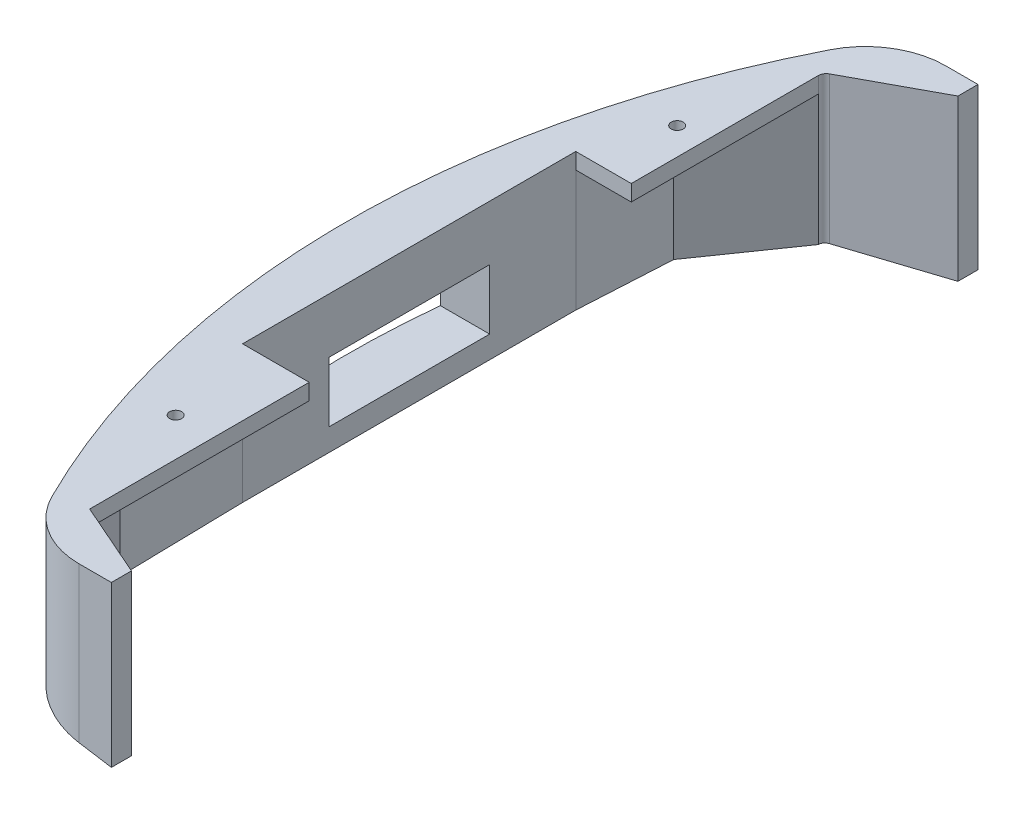
ISO-10303-21;
HEADER;
FILE_DESCRIPTION(('STEP AP214'),'2;1');
FILE_NAME('part.step','',(''),(''),'','','');
FILE_SCHEMA(('AUTOMOTIVE_DESIGN { 1 0 10303 214 1 1 1 1 }'));
ENDSEC;
DATA;
#1=APPLICATION_CONTEXT('core data for automotive mechanical design processes');
#2=APPLICATION_PROTOCOL_DEFINITION('international standard','automotive_design',2000,#1);
#3=PRODUCT_CONTEXT('',#1,'mechanical');
#4=PRODUCT('Part','Part','',(#3));
#5=PRODUCT_RELATED_PRODUCT_CATEGORY('part','',(#4));
#6=PRODUCT_DEFINITION_FORMATION('','',#4);
#7=PRODUCT_DEFINITION_CONTEXT('part definition',#1,'design');
#8=PRODUCT_DEFINITION('design','',#6,#7);
#9=PRODUCT_DEFINITION_SHAPE('','',#8);
#10=(LENGTH_UNIT() NAMED_UNIT(*) SI_UNIT(.MILLI.,.METRE.));
#11=(NAMED_UNIT(*) PLANE_ANGLE_UNIT() SI_UNIT($,.RADIAN.));
#12=(NAMED_UNIT(*) SI_UNIT($,.STERADIAN.) SOLID_ANGLE_UNIT());
#13=UNCERTAINTY_MEASURE_WITH_UNIT(LENGTH_MEASURE(1.E-05),#10,'distance_accuracy_value','');
#14=(GEOMETRIC_REPRESENTATION_CONTEXT(3) GLOBAL_UNCERTAINTY_ASSIGNED_CONTEXT((#13)) GLOBAL_UNIT_ASSIGNED_CONTEXT((#10,
#11,#12)) REPRESENTATION_CONTEXT('',''));
#15=CARTESIAN_POINT('',(0.,0.,0.));
#16=DIRECTION('',(0.,0.,1.));
#17=DIRECTION('',(1.,0.,0.));
#18=AXIS2_PLACEMENT_3D('',#15,#16,#17);
#19=CARTESIAN_POINT('',(-120.13867117166,50.8,-107.999441440313));
#20=DIRECTION('',(0.,-1.,0.));
#21=DIRECTION('',(0.,0.,-1.));
#22=AXIS2_PLACEMENT_3D('',#19,#20,#21);
#23=PLANE('',#22);
#24=CARTESIAN_POINT('',(-120.13867117166,50.8,-107.999441440313));
#25=DIRECTION('',(0.,-1.,0.));
#26=DIRECTION('',(0.,0.,-1.));
#27=AXIS2_PLACEMENT_3D('',#24,#25,#26);
#28=CIRCLE('',#27,2.54);
#29=CARTESIAN_POINT('',(-122.67867117166,50.8,-107.999441440313));
#30=VERTEX_POINT('',#29);
#31=CARTESIAN_POINT('',(-121.345326631998,50.8,-110.23452143889));
#32=VERTEX_POINT('',#31);
#33=EDGE_CURVE('E312',#30,#32,#28,.T.);
#34=ORIENTED_EDGE('',*,*,#33,.T.);
#35=DIRECTION('',(0.879952755345086,0.,-0.475061204857429));
#36=VECTOR('',#35,1.);
#37=CARTESIAN_POINT('',(-94.9613758314156,50.8,-124.478458264008));
#38=LINE('',#37,#36);
#39=CARTESIAN_POINT('',(-94.9613758314156,50.8,-124.478458264008));
#40=VERTEX_POINT('',#39);
#41=EDGE_CURVE('E315',#32,#40,#38,.T.);
#42=ORIENTED_EDGE('',*,*,#41,.T.);
#43=DIRECTION('',(2.49144537022181E-13,0.,-1.));
#44=VECTOR('',#43,1.);
#45=CARTESIAN_POINT('',(-94.9613758314156,50.8,-124.478458264008));
#46=LINE('',#45,#44);
#47=CARTESIAN_POINT('',(-94.961375831414,50.8,-130.828458264007));
#48=VERTEX_POINT('',#47);
#49=EDGE_CURVE('E317',#40,#48,#46,.T.);
#50=ORIENTED_EDGE('',*,*,#49,.T.);
#51=DIRECTION('',(-1.,0.,0.));
#52=VECTOR('',#51,1.);
#53=CARTESIAN_POINT('',(-94.961375831414,50.8,-130.828458264007));
#54=LINE('',#53,#52);
#55=CARTESIAN_POINT('',(-105.241228698568,50.8,-130.828458264008));
#56=VERTEX_POINT('',#55);
#57=EDGE_CURVE('E319',#48,#56,#54,.T.);
#58=ORIENTED_EDGE('',*,*,#57,.T.);
#59=CARTESIAN_POINT('',(-105.241228698568,50.8,-105.428458264008));
#60=DIRECTION('',(0.,1.,0.));
#61=DIRECTION('',(0.,0.,-1.));
#62=AXIS2_PLACEMENT_3D('',#59,#60,#61);
#63=CIRCLE('',#62,25.4);
#64=CARTESIAN_POINT('',(-127.91877537442,50.8,-116.869125935284));
#65=VERTEX_POINT('',#64);
#66=EDGE_CURVE('E321',#56,#65,#63,.T.);
#67=ORIENTED_EDGE('',*,*,#66,.T.);
#68=CARTESIAN_POINT('',(116.713834990151,50.8,6.54635796793397));
#69=DIRECTION('',(0.,1.,0.));
#70=DIRECTION('',(0.,0.,1.));
#71=AXIS2_PLACEMENT_3D('',#68,#69,#70);
#72=CIRCLE('',#71,274.000904598597);
#73=CARTESIAN_POINT('',(-128.532661200605,50.8,128.737404395268));
#74=VERTEX_POINT('',#73);
#75=EDGE_CURVE('E323',#65,#74,#72,.T.);
#76=ORIENTED_EDGE('',*,*,#75,.T.);
#77=CARTESIAN_POINT('',(-105.798207048452,50.8,117.410242597021));
#78=DIRECTION('',(0.,1.,0.));
#79=DIRECTION('',(0.,0.,1.));
#80=AXIS2_PLACEMENT_3D('',#77,#78,#79);
#81=CIRCLE('',#80,25.4);
#82=CARTESIAN_POINT('',(-105.798207048452,50.8,142.810242597021));
#83=VERTEX_POINT('',#82);
#84=EDGE_CURVE('E325',#74,#83,#81,.T.);
#85=ORIENTED_EDGE('',*,*,#84,.T.);
#86=DIRECTION('',(1.,0.,0.));
#87=VECTOR('',#86,1.);
#88=CARTESIAN_POINT('',(-95.6016450834867,50.8,142.810242597021));
#89=LINE('',#88,#87);
#90=CARTESIAN_POINT('',(-95.6016450834867,50.8,142.810242597021));
#91=VERTEX_POINT('',#90);
#92=EDGE_CURVE('E327',#83,#91,#89,.T.);
#93=ORIENTED_EDGE('',*,*,#92,.T.);
#94=DIRECTION('',(0.,0.,-1.));
#95=VECTOR('',#94,1.);
#96=CARTESIAN_POINT('',(-95.6016450834867,50.8,142.810242597021));
#97=LINE('',#96,#95);
#98=CARTESIAN_POINT('',(-95.6016450834867,50.8,136.460242597021));
#99=VERTEX_POINT('',#98);
#100=EDGE_CURVE('E329',#91,#99,#97,.T.);
#101=ORIENTED_EDGE('',*,*,#100,.T.);
#102=DIRECTION('',(-0.915612359132314,0.,-0.402062193950336));
#103=VECTOR('',#102,1.);
#104=CARTESIAN_POINT('',(-119.167015714981,50.8,126.112255784861));
#105=LINE('',#104,#103);
#106=CARTESIAN_POINT('',(-119.167015714981,50.8,126.112255784861));
#107=VERTEX_POINT('',#106);
#108=EDGE_CURVE('E331',#99,#107,#105,.T.);
#109=ORIENTED_EDGE('',*,*,#108,.T.);
#110=DIRECTION('',(0.,0.,-1.));
#111=VECTOR('',#110,1.);
#112=CARTESIAN_POINT('',(-119.167015714981,50.8,56.6451992567958));
#113=LINE('',#112,#111);
#114=CARTESIAN_POINT('',(-119.167015714981,50.8,56.6451992567958));
#115=VERTEX_POINT('',#114);
#116=EDGE_CURVE('E333',#107,#115,#113,.T.);
#117=ORIENTED_EDGE('',*,*,#116,.T.);
#118=DIRECTION('',(-1.,0.,0.));
#119=VECTOR('',#118,1.);
#120=CARTESIAN_POINT('',(-140.25084995853,50.8,56.6451992567958));
#121=LINE('',#120,#119);
#122=CARTESIAN_POINT('',(-140.25084995853,50.8,56.6451992567958));
#123=VERTEX_POINT('',#122);
#124=EDGE_CURVE('E335',#115,#123,#121,.T.);
#125=ORIENTED_EDGE('',*,*,#124,.T.);
#126=DIRECTION('',(0.,0.,-1.));
#127=VECTOR('',#126,1.);
#128=CARTESIAN_POINT('',(-140.25084995853,50.8,-48.8107966844399));
#129=LINE('',#128,#127);
#130=CARTESIAN_POINT('',(-140.25084995853,50.8,-48.8107966844399));
#131=VERTEX_POINT('',#130);
#132=EDGE_CURVE('E337',#123,#131,#129,.T.);
#133=ORIENTED_EDGE('',*,*,#132,.T.);
#134=DIRECTION('',(1.,0.,0.));
#135=VECTOR('',#134,1.);
#136=CARTESIAN_POINT('',(-122.67867117166,50.8,-48.8107966844399));
#137=LINE('',#136,#135);
#138=CARTESIAN_POINT('',(-122.67867117166,50.8,-48.8107966844399));
#139=VERTEX_POINT('',#138);
#140=EDGE_CURVE('E339',#131,#139,#137,.T.);
#141=ORIENTED_EDGE('',*,*,#140,.T.);
#142=DIRECTION('',(0.,0.,-1.));
#143=VECTOR('',#142,1.);
#144=CARTESIAN_POINT('',(-122.67867117166,50.8,-107.999441440313));
#145=LINE('',#144,#143);
#146=EDGE_CURVE('E341',#139,#30,#145,.T.);
#147=ORIENTED_EDGE('',*,*,#146,.T.);
#148=EDGE_LOOP('',(#34,#42,#50,#58,#67,#76,#85,#93,#101,#109,#117,#125,#133,#141,#147));
#149=FACE_BOUND('',#148,.T.);
#150=CARTESIAN_POINT('',(-131.296368681906,50.8,-71.9636007432042));
#151=DIRECTION('',(0.,1.,0.));
#152=DIRECTION('',(0.,0.,1.));
#153=AXIS2_PLACEMENT_3D('',#150,#151,#152);
#154=CIRCLE('',#153,1.90499999999999);
#155=CARTESIAN_POINT('',(-131.296368681906,50.8,-70.0586007432042));
#156=VERTEX_POINT('',#155);
#157=EDGE_CURVE('E307',#156,#156,#154,.T.);
#158=ORIENTED_EDGE('',*,*,#157,.F.);
#159=EDGE_LOOP('',(#158));
#160=FACE_BOUND('',#159,.T.);
#161=CARTESIAN_POINT('',(-131.296368681906,50.8,86.7863992567958));
#162=DIRECTION('',(0.,1.,0.));
#163=DIRECTION('',(0.,0.,1.));
#164=AXIS2_PLACEMENT_3D('',#161,#162,#163);
#165=CIRCLE('',#164,1.90499999999999);
#166=CARTESIAN_POINT('',(-131.296368681906,50.8,88.6913992567958));
#167=VERTEX_POINT('',#166);
#168=EDGE_CURVE('E304',#167,#167,#165,.T.);
#169=ORIENTED_EDGE('',*,*,#168,.F.);
#170=EDGE_LOOP('',(#169));
#171=FACE_BOUND('',#170,.T.);
#172=ADVANCED_FACE('F40',(#149,#160,#171),#23,.F.);
#173=CARTESIAN_POINT('',(-120.13867117166,50.8,-107.999441440313));
#174=DIRECTION('',(0.,-1.,0.));
#175=DIRECTION('',(0.,0.,-1.));
#176=AXIS2_PLACEMENT_3D('',#173,#174,#175);
#177=CYLINDRICAL_SURFACE('',#176,2.54);
#178=DIRECTION('',(0.,-1.,0.));
#179=VECTOR('',#178,1.);
#180=CARTESIAN_POINT('',(-122.67867117166,45.72,-107.999441440313));
#181=LINE('',#180,#179);
#182=CARTESIAN_POINT('',(-122.67867117166,45.72,-107.999441440313));
#183=VERTEX_POINT('',#182);
#184=CARTESIAN_POINT('',(-122.67867117166,4.47229703098231,-107.999441440313));
#185=VERTEX_POINT('',#184);
#186=EDGE_CURVE('E283',#183,#185,#181,.T.);
#187=ORIENTED_EDGE('',*,*,#186,.T.);
#188=CARTESIAN_POINT('',(-120.13867117166,4.06245781978765,-107.999441440313));
#189=DIRECTION('',(0.15929372832516,0.987231233357348,0.));
#190=DIRECTION('',(0.987231233357348,-0.15929372832516,0.));
#191=AXIS2_PLACEMENT_3D('',#188,#189,#190);
#192=ELLIPSE('',#191,2.57285214869271,2.54);
#193=CARTESIAN_POINT('',(-121.345326631998,4.2571565292556,-110.23452143889));
#194=VERTEX_POINT('',#193);
#195=EDGE_CURVE('E241',#185,#194,#192,.F.);
#196=ORIENTED_EDGE('',*,*,#195,.T.);
#197=DIRECTION('',(0.,-1.,0.));
#198=VECTOR('',#197,1.);
#199=CARTESIAN_POINT('',(-121.345326631998,50.8,-110.23452143889));
#200=LINE('',#199,#198);
#201=EDGE_CURVE('E48',#32,#194,#200,.T.);
#202=ORIENTED_EDGE('',*,*,#201,.F.);
#203=ORIENTED_EDGE('',*,*,#33,.F.);
#204=DIRECTION('',(0.,-1.,0.));
#205=VECTOR('',#204,1.);
#206=CARTESIAN_POINT('',(-122.67867117166,50.8,-107.999441440313));
#207=LINE('',#206,#205);
#208=EDGE_CURVE('E343',#30,#183,#207,.T.);
#209=ORIENTED_EDGE('',*,*,#208,.T.);
#210=EDGE_LOOP('',(#187,#196,#202,#203,#209));
#211=FACE_BOUND('',#210,.T.);
#212=ADVANCED_FACE('F42',(#211),#177,.F.);
#213=CARTESIAN_POINT('',(-94.9613758314156,50.8,-124.478458264008));
#214=DIRECTION('',(-0.475061204857429,0.,-0.879952755345086));
#215=DIRECTION('',(-0.879952755345086,0.,0.475061204857429));
#216=AXIS2_PLACEMENT_3D('',#213,#214,#215);
#217=PLANE('',#216);
#218=ORIENTED_EDGE('',*,*,#201,.T.);
#219=DIRECTION('',(0.871214973283533,-0.140574038358858,-0.470343927425512));
#220=VECTOR('',#219,1.);
#221=CARTESIAN_POINT('',(-101.182862350733,1.0038618612343,-121.119656482982));
#222=LINE('',#221,#220);
#223=CARTESIAN_POINT('',(-94.9613758314156,0.,-124.478458264008));
#224=VERTEX_POINT('',#223);
#225=EDGE_CURVE('E246',#194,#224,#222,.T.);
#226=ORIENTED_EDGE('',*,*,#225,.T.);
#227=DIRECTION('',(0.,-1.,0.));
#228=VECTOR('',#227,1.);
#229=CARTESIAN_POINT('',(-94.9613758314156,50.8,-124.478458264008));
#230=LINE('',#229,#228);
#231=EDGE_CURVE('E384',#40,#224,#230,.T.);
#232=ORIENTED_EDGE('',*,*,#231,.F.);
#233=ORIENTED_EDGE('',*,*,#41,.F.);
#234=EDGE_LOOP('',(#218,#226,#232,#233));
#235=FACE_BOUND('',#234,.T.);
#236=ADVANCED_FACE('F470',(#235),#217,.F.);
#237=CARTESIAN_POINT('',(-94.9613758314156,50.8,-124.478458264008));
#238=DIRECTION('',(-1.,0.,-2.49144537022181E-13));
#239=DIRECTION('',(-2.49144537022181E-13,0.,1.));
#240=AXIS2_PLACEMENT_3D('',#237,#238,#239);
#241=PLANE('',#240);
#242=DIRECTION('',(2.49144537022181E-13,0.,-1.));
#243=VECTOR('',#242,1.);
#244=CARTESIAN_POINT('',(-94.9613758314156,0.,-124.478458264008));
#245=LINE('',#244,#243);
#246=CARTESIAN_POINT('',(-94.9613758314156,0.,-130.828458264008));
#247=VERTEX_POINT('',#246);
#248=EDGE_CURVE('E311',#224,#247,#245,.T.);
#249=ORIENTED_EDGE('',*,*,#248,.T.);
#250=DIRECTION('',(0.,-1.,0.));
#251=VECTOR('',#250,1.);
#252=CARTESIAN_POINT('',(-94.961375831414,50.8,-130.828458264007));
#253=LINE('',#252,#251);
#254=EDGE_CURVE('E381',#48,#247,#253,.T.);
#255=ORIENTED_EDGE('',*,*,#254,.F.);
#256=ORIENTED_EDGE('',*,*,#49,.F.);
#257=ORIENTED_EDGE('',*,*,#231,.T.);
#258=EDGE_LOOP('',(#249,#255,#256,#257));
#259=FACE_BOUND('',#258,.T.);
#260=ADVANCED_FACE('F467',(#259),#241,.F.);
#261=CARTESIAN_POINT('',(-94.961375831414,50.8,-130.828458264007));
#262=DIRECTION('',(0.,0.,1.));
#263=DIRECTION('',(1.,0.,0.));
#264=AXIS2_PLACEMENT_3D('',#261,#262,#263);
#265=PLANE('',#264);
#266=ORIENTED_EDGE('',*,*,#254,.T.);
#267=DIRECTION('',(-0.987231233357348,0.15929372832516,0.));
#268=VECTOR('',#267,1.);
#269=CARTESIAN_POINT('',(-157.287069608446,10.0565012498968,-130.828458264008));
#270=LINE('',#269,#268);
#271=CARTESIAN_POINT('',(-105.241228698568,1.65869558672087,-130.828458264008));
#272=VERTEX_POINT('',#271);
#273=EDGE_CURVE('E232',#247,#272,#270,.T.);
#274=ORIENTED_EDGE('',*,*,#273,.T.);
#275=DIRECTION('',(0.,-1.,0.));
#276=VECTOR('',#275,1.);
#277=CARTESIAN_POINT('',(-105.241228698568,50.8,-130.828458264008));
#278=LINE('',#277,#276);
#279=EDGE_CURVE('E378',#56,#272,#278,.T.);
#280=ORIENTED_EDGE('',*,*,#279,.F.);
#281=ORIENTED_EDGE('',*,*,#57,.F.);
#282=EDGE_LOOP('',(#266,#274,#280,#281));
#283=FACE_BOUND('',#282,.T.);
#284=ADVANCED_FACE('F463',(#283),#265,.F.);
#285=CARTESIAN_POINT('',(-105.241228698568,50.8,-105.428458264008));
#286=DIRECTION('',(0.,-1.,0.));
#287=DIRECTION('',(0.,0.,-1.));
#288=AXIS2_PLACEMENT_3D('',#285,#286,#287);
#289=CYLINDRICAL_SURFACE('',#288,25.4);
#290=ORIENTED_EDGE('',*,*,#279,.T.);
#291=CARTESIAN_POINT('',(-105.241228698568,1.65869558672088,-105.428458264008));
#292=DIRECTION('',(0.15929372832516,0.987231233357348,0.));
#293=DIRECTION('',(0.987231233357348,-0.15929372832516,0.));
#294=AXIS2_PLACEMENT_3D('',#291,#292,#293);
#295=ELLIPSE('',#294,25.728521486927,25.4);
#296=CARTESIAN_POINT('',(-127.91877537442,5.31780891013072,-116.869125935284));
#297=VERTEX_POINT('',#296);
#298=EDGE_CURVE('E262',#272,#297,#295,.T.);
#299=ORIENTED_EDGE('',*,*,#298,.T.);
#300=DIRECTION('',(0.,-1.,0.));
#301=VECTOR('',#300,1.);
#302=CARTESIAN_POINT('',(-127.91877537442,50.8,-116.869125935284));
#303=LINE('',#302,#301);
#304=EDGE_CURVE('E375',#65,#297,#303,.T.);
#305=ORIENTED_EDGE('',*,*,#304,.F.);
#306=ORIENTED_EDGE('',*,*,#66,.F.);
#307=EDGE_LOOP('',(#290,#299,#305,#306));
#308=FACE_BOUND('',#307,.T.);
#309=ADVANCED_FACE('F459',(#308),#289,.T.);
#310=CARTESIAN_POINT('',(116.713834990151,50.8,6.54635796793397));
#311=DIRECTION('',(0.,-1.,0.));
#312=DIRECTION('',(0.,0.,-1.));
#313=AXIS2_PLACEMENT_3D('',#310,#311,#312);
#314=CYLINDRICAL_SURFACE('',#313,274.000904598597);
#315=CARTESIAN_POINT('',(116.713834990151,33.4172726963735,6.54635796793397));
#316=DIRECTION('',(0.,1.,0.));
#317=DIRECTION('',(0.,0.,1.));
#318=AXIS2_PLACEMENT_3D('',#315,#316,#317);
#319=CIRCLE('',#318,274.000904598597);
#320=CARTESIAN_POINT('',(-155.84234857806,33.4172726963735,-21.5538647995298));
#321=VERTEX_POINT('',#320);
#322=CARTESIAN_POINT('',(-156.345161994827,33.4172726963735,29.2461352004702));
#323=VERTEX_POINT('',#322);
#324=EDGE_CURVE('E225',#321,#323,#319,.T.);
#325=ORIENTED_EDGE('',*,*,#324,.T.);
#326=DIRECTION('',(0.,-1.,0.));
#327=VECTOR('',#326,1.);
#328=CARTESIAN_POINT('',(-156.345161994827,50.8,29.2461352004702));
#329=LINE('',#328,#327);
#330=CARTESIAN_POINT('',(-156.345161994827,14.3672726963735,29.2461352004702));
#331=VERTEX_POINT('',#330);
#332=EDGE_CURVE('E228',#323,#331,#329,.T.);
#333=ORIENTED_EDGE('',*,*,#332,.T.);
#334=CARTESIAN_POINT('',(116.713834990151,14.3672726963735,6.54635796793397));
#335=DIRECTION('',(0.,-1.,0.));
#336=DIRECTION('',(0.,0.,-1.));
#337=AXIS2_PLACEMENT_3D('',#334,#335,#336);
#338=CIRCLE('',#337,274.000904598597);
#339=CARTESIAN_POINT('',(-155.84234857806,14.3672726963735,-21.5538647995298));
#340=VERTEX_POINT('',#339);
#341=EDGE_CURVE('E220',#331,#340,#338,.T.);
#342=ORIENTED_EDGE('',*,*,#341,.T.);
#343=DIRECTION('',(0.,-1.,0.));
#344=VECTOR('',#343,1.);
#345=CARTESIAN_POINT('',(-155.84234857806,50.8,-21.5538647995298));
#346=LINE('',#345,#344);
#347=EDGE_CURVE('E200',#340,#321,#346,.F.);
#348=ORIENTED_EDGE('',*,*,#347,.T.);
#349=EDGE_LOOP('',(#325,#333,#342,#348));
#350=FACE_BOUND('',#349,.T.);
#351=ORIENTED_EDGE('',*,*,#304,.T.);
#352=CARTESIAN_POINT('',(116.713834990151,-34.154646233297,6.54635796793397));
#353=DIRECTION('',(0.15929372832516,0.987231233357348,0.));
#354=DIRECTION('',(0.987231233357348,-0.15929372832516,0.));
#355=AXIS2_PLACEMENT_3D('',#352,#353,#354);
#356=ELLIPSE('',#355,277.544809504033,274.000904598597);
#357=CARTESIAN_POINT('',(-128.532661200605,5.4168618561021,128.737404395268));
#358=VERTEX_POINT('',#357);
#359=EDGE_CURVE('E260',#297,#358,#356,.T.);
#360=ORIENTED_EDGE('',*,*,#359,.T.);
#361=DIRECTION('',(0.,-1.,0.));
#362=VECTOR('',#361,1.);
#363=CARTESIAN_POINT('',(-128.532661200605,50.8,128.737404395268));
#364=LINE('',#363,#362);
#365=EDGE_CURVE('E372',#74,#358,#364,.T.);
#366=ORIENTED_EDGE('',*,*,#365,.F.);
#367=ORIENTED_EDGE('',*,*,#75,.F.);
#368=EDGE_LOOP('',(#351,#360,#366,#367));
#369=FACE_BOUND('',#368,.T.);
#370=ADVANCED_FACE('F455',(#350,#369),#314,.T.);
#371=CARTESIAN_POINT('',(-105.798207048452,50.8,117.410242597021));
#372=DIRECTION('',(0.,-1.,0.));
#373=DIRECTION('',(0.,0.,-1.));
#374=AXIS2_PLACEMENT_3D('',#371,#372,#373);
#375=CYLINDRICAL_SURFACE('',#374,25.4);
#376=ORIENTED_EDGE('',*,*,#365,.T.);
#377=CARTESIAN_POINT('',(-105.798207048452,1.74856628261411,117.410242597021));
#378=DIRECTION('',(0.15929372832516,0.987231233357348,0.));
#379=DIRECTION('',(0.987231233357348,-0.15929372832516,0.));
#380=AXIS2_PLACEMENT_3D('',#377,#378,#379);
#381=ELLIPSE('',#380,25.728521486927,25.4);
#382=CARTESIAN_POINT('',(-105.798207048452,1.74856628261411,142.810242597021));
#383=VERTEX_POINT('',#382);
#384=EDGE_CURVE('E257',#358,#383,#381,.T.);
#385=ORIENTED_EDGE('',*,*,#384,.T.);
#386=DIRECTION('',(0.,-1.,0.));
#387=VECTOR('',#386,1.);
#388=CARTESIAN_POINT('',(-105.798207048452,50.8,142.810242597021));
#389=LINE('',#388,#387);
#390=EDGE_CURVE('E369',#83,#383,#389,.T.);
#391=ORIENTED_EDGE('',*,*,#390,.F.);
#392=ORIENTED_EDGE('',*,*,#84,.F.);
#393=EDGE_LOOP('',(#376,#385,#391,#392));
#394=FACE_BOUND('',#393,.T.);
#395=ADVANCED_FACE('F451',(#394),#375,.T.);
#396=CARTESIAN_POINT('',(-95.6016450834867,50.8,142.810242597021));
#397=DIRECTION('',(0.,0.,-1.));
#398=DIRECTION('',(-1.,0.,0.));
#399=AXIS2_PLACEMENT_3D('',#396,#397,#398);
#400=PLANE('',#399);
#401=ORIENTED_EDGE('',*,*,#390,.T.);
#402=DIRECTION('',(-0.987231233357348,0.15929372832516,0.));
#403=VECTOR('',#402,1.);
#404=CARTESIAN_POINT('',(-157.287069608446,10.0565012498968,142.810242597021));
#405=LINE('',#404,#403);
#406=CARTESIAN_POINT('',(-95.6016450834867,0.10331001780356,142.810242597021));
#407=VERTEX_POINT('',#406);
#408=EDGE_CURVE('E231',#407,#383,#405,.T.);
#409=ORIENTED_EDGE('',*,*,#408,.F.);
#410=DIRECTION('',(0.,-1.,0.));
#411=VECTOR('',#410,1.);
#412=CARTESIAN_POINT('',(-95.6016450834867,50.8,142.810242597021));
#413=LINE('',#412,#411);
#414=EDGE_CURVE('E366',#91,#407,#413,.T.);
#415=ORIENTED_EDGE('',*,*,#414,.F.);
#416=ORIENTED_EDGE('',*,*,#92,.F.);
#417=EDGE_LOOP('',(#401,#409,#415,#416));
#418=FACE_BOUND('',#417,.T.);
#419=ADVANCED_FACE('F447',(#418),#400,.F.);
#420=CARTESIAN_POINT('',(-95.6016450834867,50.8,142.810242597021));
#421=DIRECTION('',(-1.,0.,0.));
#422=DIRECTION('',(0.,0.,1.));
#423=AXIS2_PLACEMENT_3D('',#420,#421,#422);
#424=PLANE('',#423);
#425=ORIENTED_EDGE('',*,*,#414,.T.);
#426=DIRECTION('',(0.,0.,-1.));
#427=VECTOR('',#426,1.);
#428=CARTESIAN_POINT('',(-95.6016450834867,0.10331001780356,142.810242597021));
#429=LINE('',#428,#427);
#430=CARTESIAN_POINT('',(-95.6016450834867,0.103310017803553,136.460242597021));
#431=VERTEX_POINT('',#430);
#432=EDGE_CURVE('E254',#407,#431,#429,.T.);
#433=ORIENTED_EDGE('',*,*,#432,.T.);
#434=DIRECTION('',(0.,-1.,0.));
#435=VECTOR('',#434,1.);
#436=CARTESIAN_POINT('',(-95.6016450834867,50.8,136.460242597021));
#437=LINE('',#436,#435);
#438=EDGE_CURVE('E363',#99,#431,#437,.T.);
#439=ORIENTED_EDGE('',*,*,#438,.F.);
#440=ORIENTED_EDGE('',*,*,#100,.F.);
#441=EDGE_LOOP('',(#425,#433,#439,#440));
#442=FACE_BOUND('',#441,.T.);
#443=ADVANCED_FACE('F443',(#442),#424,.F.);
#444=CARTESIAN_POINT('',(-119.167015714981,50.8,126.112255784861));
#445=DIRECTION('',(-0.402062193950336,0.,0.915612359132314));
#446=DIRECTION('',(0.915612359132315,0.,0.402062193950336));
#447=AXIS2_PLACEMENT_3D('',#444,#445,#446);
#448=PLANE('',#447);
#449=ORIENTED_EDGE('',*,*,#438,.T.);
#450=DIRECTION('',(-0.905780733225963,0.146151362685295,-0.397744946544728));
#451=VECTOR('',#450,1.);
#452=CARTESIAN_POINT('',(-125.374937195622,4.90735039335706,123.386243509598));
#453=LINE('',#452,#451);
#454=CARTESIAN_POINT('',(-119.167015714981,3.90567730564666,126.112255784861));
#455=VERTEX_POINT('',#454);
#456=EDGE_CURVE('E251',#431,#455,#453,.T.);
#457=ORIENTED_EDGE('',*,*,#456,.T.);
#458=DIRECTION('',(0.,-1.,0.));
#459=VECTOR('',#458,1.);
#460=CARTESIAN_POINT('',(-119.167015714981,45.72,126.112255784861));
#461=LINE('',#460,#459);
#462=CARTESIAN_POINT('',(-119.167015714981,45.72,126.112255784861));
#463=VERTEX_POINT('',#462);
#464=EDGE_CURVE('E296',#463,#455,#461,.T.);
#465=ORIENTED_EDGE('',*,*,#464,.F.);
#466=DIRECTION('',(0.,-1.,0.));
#467=VECTOR('',#466,1.);
#468=CARTESIAN_POINT('',(-119.167015714981,50.8,126.112255784861));
#469=LINE('',#468,#467);
#470=EDGE_CURVE('E360',#107,#463,#469,.T.);
#471=ORIENTED_EDGE('',*,*,#470,.F.);
#472=ORIENTED_EDGE('',*,*,#108,.F.);
#473=EDGE_LOOP('',(#449,#457,#465,#471,#472));
#474=FACE_BOUND('',#473,.T.);
#475=ADVANCED_FACE('F439',(#474),#448,.F.);
#476=CARTESIAN_POINT('',(-119.167015714981,50.8,56.6451992567958));
#477=DIRECTION('',(-1.,0.,0.));
#478=DIRECTION('',(0.,0.,1.));
#479=AXIS2_PLACEMENT_3D('',#476,#477,#478);
#480=PLANE('',#479);
#481=ORIENTED_EDGE('',*,*,#470,.T.);
#482=DIRECTION('',(0.,0.,-1.));
#483=VECTOR('',#482,1.);
#484=CARTESIAN_POINT('',(-119.167015714981,45.72,126.112255784861));
#485=LINE('',#484,#483);
#486=CARTESIAN_POINT('',(-119.167015714981,45.72,56.6451992567958));
#487=VERTEX_POINT('',#486);
#488=EDGE_CURVE('E265',#463,#487,#485,.T.);
#489=ORIENTED_EDGE('',*,*,#488,.T.);
#490=DIRECTION('',(0.,-1.,0.));
#491=VECTOR('',#490,1.);
#492=CARTESIAN_POINT('',(-119.167015714981,50.8,56.6451992567958));
#493=LINE('',#492,#491);
#494=EDGE_CURVE('E357',#115,#487,#493,.T.);
#495=ORIENTED_EDGE('',*,*,#494,.F.);
#496=ORIENTED_EDGE('',*,*,#116,.F.);
#497=EDGE_LOOP('',(#481,#489,#495,#496));
#498=FACE_BOUND('',#497,.T.);
#499=ADVANCED_FACE('F435',(#498),#480,.F.);
#500=CARTESIAN_POINT('',(-140.25084995853,50.8,56.6451992567958));
#501=DIRECTION('',(0.,0.,1.));
#502=DIRECTION('',(1.,0.,0.));
#503=AXIS2_PLACEMENT_3D('',#500,#501,#502);
#504=PLANE('',#503);
#505=ORIENTED_EDGE('',*,*,#494,.T.);
#506=DIRECTION('',(-1.,0.,0.));
#507=VECTOR('',#506,1.);
#508=CARTESIAN_POINT('',(-119.167015714981,45.72,56.6451992567958));
#509=LINE('',#508,#507);
#510=CARTESIAN_POINT('',(-140.25084995853,45.72,56.6451992567958));
#511=VERTEX_POINT('',#510);
#512=EDGE_CURVE('E289',#487,#511,#509,.T.);
#513=ORIENTED_EDGE('',*,*,#512,.T.);
#514=DIRECTION('',(0.,-1.,0.));
#515=VECTOR('',#514,1.);
#516=CARTESIAN_POINT('',(-140.25084995853,50.8,56.6451992567958));
#517=LINE('',#516,#515);
#518=EDGE_CURVE('E354',#123,#511,#517,.T.);
#519=ORIENTED_EDGE('',*,*,#518,.F.);
#520=ORIENTED_EDGE('',*,*,#124,.F.);
#521=EDGE_LOOP('',(#505,#513,#519,#520));
#522=FACE_BOUND('',#521,.T.);
#523=ADVANCED_FACE('F432',(#522),#504,.F.);
#524=CARTESIAN_POINT('',(-140.25084995853,50.8,-48.8107966844399));
#525=DIRECTION('',(-1.,0.,0.));
#526=DIRECTION('',(0.,0.,1.));
#527=AXIS2_PLACEMENT_3D('',#524,#525,#526);
#528=PLANE('',#527);
#529=DIRECTION('',(0.,0.,-1.));
#530=VECTOR('',#529,1.);
#531=CARTESIAN_POINT('',(-140.25084995853,14.3672726963735,29.2461352004702));
#532=LINE('',#531,#530);
#533=CARTESIAN_POINT('',(-140.25084995853,14.3672726963735,29.2461352004702));
#534=VERTEX_POINT('',#533);
#535=CARTESIAN_POINT('',(-140.25084995853,14.3672726963735,-21.5538647995298));
#536=VERTEX_POINT('',#535);
#537=EDGE_CURVE('E206',#534,#536,#532,.T.);
#538=ORIENTED_EDGE('',*,*,#537,.F.);
#539=DIRECTION('',(0.,-1.,0.));
#540=VECTOR('',#539,1.);
#541=CARTESIAN_POINT('',(-140.25084995853,33.4172726963735,29.2461352004702));
#542=LINE('',#541,#540);
#543=CARTESIAN_POINT('',(-140.25084995853,33.4172726963735,29.2461352004702));
#544=VERTEX_POINT('',#543);
#545=EDGE_CURVE('E63',#544,#534,#542,.T.);
#546=ORIENTED_EDGE('',*,*,#545,.F.);
#547=DIRECTION('',(0.,0.,1.));
#548=VECTOR('',#547,1.);
#549=CARTESIAN_POINT('',(-140.25084995853,33.4172726963735,29.2461352004702));
#550=LINE('',#549,#548);
#551=CARTESIAN_POINT('',(-140.25084995853,33.4172726963735,-21.5538647995298));
#552=VERTEX_POINT('',#551);
#553=EDGE_CURVE('E213',#552,#544,#550,.T.);
#554=ORIENTED_EDGE('',*,*,#553,.F.);
#555=DIRECTION('',(0.,1.,0.));
#556=VECTOR('',#555,1.);
#557=CARTESIAN_POINT('',(-140.25084995853,33.4172726963735,-21.5538647995298));
#558=LINE('',#557,#556);
#559=EDGE_CURVE('E197',#536,#552,#558,.T.);
#560=ORIENTED_EDGE('',*,*,#559,.F.);
#561=EDGE_LOOP('',(#538,#546,#554,#560));
#562=FACE_BOUND('',#561,.T.);
#563=DIRECTION('',(0.,-1.,0.));
#564=VECTOR('',#563,1.);
#565=CARTESIAN_POINT('',(-140.25084995853,45.72,56.6451992567958));
#566=LINE('',#565,#564);
#567=CARTESIAN_POINT('',(-140.25084995853,7.30763872113292,56.6451992567958));
#568=VERTEX_POINT('',#567);
#569=EDGE_CURVE('E270',#511,#568,#566,.T.);
#570=ORIENTED_EDGE('',*,*,#569,.T.);
#571=DIRECTION('',(0.,0.,-1.));
#572=VECTOR('',#571,1.);
#573=CARTESIAN_POINT('',(-140.25084995853,7.30763872113292,-48.8107966844399));
#574=LINE('',#573,#572);
#575=CARTESIAN_POINT('',(-140.25084995853,7.30763872113291,-48.8107966844399));
#576=VERTEX_POINT('',#575);
#577=EDGE_CURVE('E238',#568,#576,#574,.T.);
#578=ORIENTED_EDGE('',*,*,#577,.T.);
#579=DIRECTION('',(0.,-1.,0.));
#580=VECTOR('',#579,1.);
#581=CARTESIAN_POINT('',(-140.25084995853,45.72,-48.8107966844399));
#582=LINE('',#581,#580);
#583=CARTESIAN_POINT('',(-140.25084995853,45.72,-48.8107966844399));
#584=VERTEX_POINT('',#583);
#585=EDGE_CURVE('E277',#584,#576,#582,.T.);
#586=ORIENTED_EDGE('',*,*,#585,.F.);
#587=DIRECTION('',(0.,-1.,0.));
#588=VECTOR('',#587,1.);
#589=CARTESIAN_POINT('',(-140.25084995853,50.8,-48.8107966844399));
#590=LINE('',#589,#588);
#591=EDGE_CURVE('E351',#131,#584,#590,.T.);
#592=ORIENTED_EDGE('',*,*,#591,.F.);
#593=ORIENTED_EDGE('',*,*,#132,.F.);
#594=ORIENTED_EDGE('',*,*,#518,.T.);
#595=EDGE_LOOP('',(#570,#578,#586,#592,#593,#594));
#596=FACE_BOUND('',#595,.T.);
#597=ADVANCED_FACE('F210',(#562,#596),#528,.F.);
#598=CARTESIAN_POINT('',(-122.67867117166,50.8,-48.8107966844399));
#599=DIRECTION('',(0.,0.,-1.));
#600=DIRECTION('',(-1.,0.,0.));
#601=AXIS2_PLACEMENT_3D('',#598,#599,#600);
#602=PLANE('',#601);
#603=ORIENTED_EDGE('',*,*,#591,.T.);
#604=DIRECTION('',(1.,0.,0.));
#605=VECTOR('',#604,1.);
#606=CARTESIAN_POINT('',(-140.25084995853,45.72,-48.8107966844399));
#607=LINE('',#606,#605);
#608=CARTESIAN_POINT('',(-122.67867117166,45.72,-48.8107966844399));
#609=VERTEX_POINT('',#608);
#610=EDGE_CURVE('E266',#584,#609,#607,.T.);
#611=ORIENTED_EDGE('',*,*,#610,.T.);
#612=DIRECTION('',(0.,-1.,0.));
#613=VECTOR('',#612,1.);
#614=CARTESIAN_POINT('',(-122.67867117166,50.8,-48.8107966844399));
#615=LINE('',#614,#613);
#616=EDGE_CURVE('E348',#139,#609,#615,.T.);
#617=ORIENTED_EDGE('',*,*,#616,.F.);
#618=ORIENTED_EDGE('',*,*,#140,.F.);
#619=EDGE_LOOP('',(#603,#611,#617,#618));
#620=FACE_BOUND('',#619,.T.);
#621=ADVANCED_FACE('F425',(#620),#602,.F.);
#622=CARTESIAN_POINT('',(-122.67867117166,50.8,-107.999441440313));
#623=DIRECTION('',(-1.,0.,0.));
#624=DIRECTION('',(0.,0.,1.));
#625=AXIS2_PLACEMENT_3D('',#622,#623,#624);
#626=PLANE('',#625);
#627=ORIENTED_EDGE('',*,*,#616,.T.);
#628=DIRECTION('',(0.,0.,-1.));
#629=VECTOR('',#628,1.);
#630=CARTESIAN_POINT('',(-122.67867117166,45.72,-48.8107966844399));
#631=LINE('',#630,#629);
#632=EDGE_CURVE('E269',#609,#183,#631,.T.);
#633=ORIENTED_EDGE('',*,*,#632,.T.);
#634=ORIENTED_EDGE('',*,*,#208,.F.);
#635=ORIENTED_EDGE('',*,*,#146,.F.);
#636=EDGE_LOOP('',(#627,#633,#634,#635));
#637=FACE_BOUND('',#636,.T.);
#638=ADVANCED_FACE('F400',(#637),#626,.F.);
#639=CARTESIAN_POINT('',(-131.296368681906,50.8,-71.9636007432042));
#640=DIRECTION('',(0.,-1.,0.));
#641=DIRECTION('',(0.,0.,-1.));
#642=AXIS2_PLACEMENT_3D('',#639,#640,#641);
#643=CYLINDRICAL_SURFACE('',#642,1.90499999999999);
#644=CARTESIAN_POINT('',(-131.296368681906,45.72,-71.9636007432042));
#645=DIRECTION('',(0.,1.,0.));
#646=DIRECTION('',(0.,0.,1.));
#647=AXIS2_PLACEMENT_3D('',#644,#645,#646);
#648=CIRCLE('',#647,1.90499999999999);
#649=CARTESIAN_POINT('',(-131.296368681906,45.72,-70.0586007432042));
#650=VERTEX_POINT('',#649);
#651=EDGE_CURVE('E308',#650,#650,#648,.T.);
#652=ORIENTED_EDGE('',*,*,#651,.F.);
#653=EDGE_LOOP('',(#652));
#654=FACE_BOUND('',#653,.T.);
#655=ORIENTED_EDGE('',*,*,#157,.T.);
#656=EDGE_LOOP('',(#655));
#657=FACE_BOUND('',#656,.T.);
#658=ADVANCED_FACE('F396',(#654,#657),#643,.F.);
#659=CARTESIAN_POINT('',(-131.296368681906,50.8,86.7863992567958));
#660=DIRECTION('',(0.,-1.,0.));
#661=DIRECTION('',(0.,0.,-1.));
#662=AXIS2_PLACEMENT_3D('',#659,#660,#661);
#663=CYLINDRICAL_SURFACE('',#662,1.90499999999999);
#664=CARTESIAN_POINT('',(-131.296368681906,45.72,86.7863992567958));
#665=DIRECTION('',(0.,1.,0.));
#666=DIRECTION('',(0.,0.,1.));
#667=AXIS2_PLACEMENT_3D('',#664,#665,#666);
#668=CIRCLE('',#667,1.90499999999999);
#669=CARTESIAN_POINT('',(-131.296368681906,45.72,88.6913992567958));
#670=VERTEX_POINT('',#669);
#671=EDGE_CURVE('E286',#670,#670,#668,.T.);
#672=ORIENTED_EDGE('',*,*,#671,.F.);
#673=EDGE_LOOP('',(#672));
#674=FACE_BOUND('',#673,.T.);
#675=ORIENTED_EDGE('',*,*,#168,.T.);
#676=EDGE_LOOP('',(#675));
#677=FACE_BOUND('',#676,.T.);
#678=ADVANCED_FACE('F399',(#674,#677),#663,.F.);
#679=CARTESIAN_POINT('',(-140.25084995853,45.72,56.6451992567958));
#680=DIRECTION('',(0.999839432639536,0.,-0.0179195128017252));
#681=DIRECTION('',(-0.0179195128017252,0.,-0.999839432639536));
#682=AXIS2_PLACEMENT_3D('',#679,#680,#681);
#683=PLANE('',#682);
#684=DIRECTION('',(0.0179194378976484,-0.00289137334371021,0.999835253282069));
#685=VECTOR('',#684,1.);
#686=CARTESIAN_POINT('',(-140.252840171537,7.3079598500025,56.5341530768333));
#687=LINE('',#686,#685);
#688=CARTESIAN_POINT('',(-139.542068036554,7.19327390860855,96.1924862045695));
#689=VERTEX_POINT('',#688);
#690=EDGE_CURVE('E244',#568,#689,#687,.T.);
#691=ORIENTED_EDGE('',*,*,#690,.F.);
#692=ORIENTED_EDGE('',*,*,#569,.F.);
#693=DIRECTION('',(0.0179195128017252,0.,0.999839432639536));
#694=VECTOR('',#693,1.);
#695=CARTESIAN_POINT('',(-140.25084995853,45.72,56.6451992567958));
#696=LINE('',#695,#694);
#697=CARTESIAN_POINT('',(-139.542068036554,45.72,96.1924862045695));
#698=VERTEX_POINT('',#697);
#699=EDGE_CURVE('E292',#511,#698,#696,.T.);
#700=ORIENTED_EDGE('',*,*,#699,.T.);
#701=DIRECTION('',(0.,-1.,0.));
#702=VECTOR('',#701,1.);
#703=CARTESIAN_POINT('',(-139.542068036554,45.72,96.1924862045695));
#704=LINE('',#703,#702);
#705=EDGE_CURVE('E299',#698,#689,#704,.T.);
#706=ORIENTED_EDGE('',*,*,#705,.T.);
#707=EDGE_LOOP('',(#691,#692,#700,#706));
#708=FACE_BOUND('',#707,.T.);
#709=ADVANCED_FACE('F411',(#708),#683,.T.);
#710=CARTESIAN_POINT('',(-139.542068036554,45.72,96.1924862045695));
#711=DIRECTION('',(0.826545969979296,0.,-0.562869220610778));
#712=DIRECTION('',(-0.562869220610778,0.,-0.826545969979296));
#713=AXIS2_PLACEMENT_3D('',#710,#711,#712);
#714=PLANE('',#713);
#715=DIRECTION('',(0.560562072446866,-0.0904489439359321,0.823158035540533));
#716=VECTOR('',#715,1.);
#717=CARTESIAN_POINT('',(-141.495459636792,7.50846149624481,93.324026008404));
#718=LINE('',#717,#716);
#719=EDGE_CURVE('E249',#689,#455,#718,.T.);
#720=ORIENTED_EDGE('',*,*,#719,.F.);
#721=ORIENTED_EDGE('',*,*,#705,.F.);
#722=DIRECTION('',(0.562869220610778,0.,0.826545969979296));
#723=VECTOR('',#722,1.);
#724=CARTESIAN_POINT('',(-139.542068036554,45.72,96.1924862045695));
#725=LINE('',#724,#723);
#726=EDGE_CURVE('E294',#698,#463,#725,.T.);
#727=ORIENTED_EDGE('',*,*,#726,.T.);
#728=ORIENTED_EDGE('',*,*,#464,.T.);
#729=EDGE_LOOP('',(#720,#721,#727,#728));
#730=FACE_BOUND('',#729,.T.);
#731=ADVANCED_FACE('F417',(#730),#714,.T.);
#732=CARTESIAN_POINT('',(0.,45.72,0.));
#733=DIRECTION('',(0.,1.,0.));
#734=DIRECTION('',(0.,0.,1.));
#735=AXIS2_PLACEMENT_3D('',#732,#733,#734);
#736=PLANE('',#735);
#737=ORIENTED_EDGE('',*,*,#671,.T.);
#738=EDGE_LOOP('',(#737));
#739=FACE_BOUND('',#738,.T.);
#740=ORIENTED_EDGE('',*,*,#488,.F.);
#741=ORIENTED_EDGE('',*,*,#726,.F.);
#742=ORIENTED_EDGE('',*,*,#699,.F.);
#743=ORIENTED_EDGE('',*,*,#512,.F.);
#744=EDGE_LOOP('',(#740,#741,#742,#743));
#745=FACE_BOUND('',#744,.T.);
#746=ADVANCED_FACE('F506',(#739,#745),#736,.F.);
#747=CARTESIAN_POINT('',(-122.67867117166,45.72,-107.999441440313));
#748=DIRECTION('',(0.877742702186898,0.,0.479132287325371));
#749=DIRECTION('',(0.479132287325371,0.,-0.877742702186898));
#750=AXIS2_PLACEMENT_3D('',#747,#748,#749);
#751=PLANE('',#750);
#752=DIRECTION('',(-0.477706829295867,0.077079917362567,0.875131345332499));
#753=VECTOR('',#752,1.);
#754=CARTESIAN_POINT('',(-124.19747771198,4.71736257210133,-105.217075500748));
#755=LINE('',#754,#753);
#756=CARTESIAN_POINT('',(-138.833286114577,7.07890909608419,-78.4051190623766));
#757=VERTEX_POINT('',#756);
#758=EDGE_CURVE('E235',#185,#757,#755,.T.);
#759=ORIENTED_EDGE('',*,*,#758,.F.);
#760=ORIENTED_EDGE('',*,*,#186,.F.);
#761=DIRECTION('',(-0.479132287325371,0.,0.877742702186898));
#762=VECTOR('',#761,1.);
#763=CARTESIAN_POINT('',(-122.67867117166,45.72,-107.999441440313));
#764=LINE('',#763,#762);
#765=CARTESIAN_POINT('',(-138.833286114577,45.72,-78.4051190623766));
#766=VERTEX_POINT('',#765);
#767=EDGE_CURVE('E273',#183,#766,#764,.T.);
#768=ORIENTED_EDGE('',*,*,#767,.T.);
#769=DIRECTION('',(0.,-1.,0.));
#770=VECTOR('',#769,1.);
#771=CARTESIAN_POINT('',(-138.833286114577,45.72,-78.4051190623766));
#772=LINE('',#771,#770);
#773=EDGE_CURVE('E280',#766,#757,#772,.T.);
#774=ORIENTED_EDGE('',*,*,#773,.T.);
#775=EDGE_LOOP('',(#759,#760,#768,#774));
#776=FACE_BOUND('',#775,.T.);
#777=ADVANCED_FACE('F487',(#776),#751,.T.);
#778=CARTESIAN_POINT('',(-138.833286114577,45.72,-78.4051190623766));
#779=DIRECTION('',(0.998854772123279,0.,0.0478450018973053));
#780=DIRECTION('',(0.0478450018973053,0.,-0.998854772123279));
#781=AXIS2_PLACEMENT_3D('',#778,#779,#780);
#782=PLANE('',#781);
#783=DIRECTION('',(-0.0478435762243813,0.00771975336241419,0.99882500850854));
#784=VECTOR('',#783,1.);
#785=CARTESIAN_POINT('',(-138.847557838602,7.08121189613013,-78.1071698705431));
#786=LINE('',#785,#784);
#787=EDGE_CURVE('E11',#757,#576,#786,.T.);
#788=ORIENTED_EDGE('',*,*,#787,.F.);
#789=ORIENTED_EDGE('',*,*,#773,.F.);
#790=DIRECTION('',(-0.0478450018973053,0.,0.998854772123279));
#791=VECTOR('',#790,1.);
#792=CARTESIAN_POINT('',(-138.833286114577,45.72,-78.4051190623766));
#793=LINE('',#792,#791);
#794=EDGE_CURVE('E275',#766,#584,#793,.T.);
#795=ORIENTED_EDGE('',*,*,#794,.T.);
#796=ORIENTED_EDGE('',*,*,#585,.T.);
#797=EDGE_LOOP('',(#788,#789,#795,#796));
#798=FACE_BOUND('',#797,.T.);
#799=ADVANCED_FACE('F491',(#798),#782,.T.);
#800=CARTESIAN_POINT('',(0.,45.72,0.));
#801=DIRECTION('',(0.,1.,0.));
#802=DIRECTION('',(0.,0.,1.));
#803=AXIS2_PLACEMENT_3D('',#800,#801,#802);
#804=PLANE('',#803);
#805=ORIENTED_EDGE('',*,*,#651,.T.);
#806=EDGE_LOOP('',(#805));
#807=FACE_BOUND('',#806,.T.);
#808=ORIENTED_EDGE('',*,*,#610,.F.);
#809=ORIENTED_EDGE('',*,*,#794,.F.);
#810=ORIENTED_EDGE('',*,*,#767,.F.);
#811=ORIENTED_EDGE('',*,*,#632,.F.);
#812=EDGE_LOOP('',(#808,#809,#810,#811));
#813=FACE_BOUND('',#812,.T.);
#814=ADVANCED_FACE('F393',(#807,#813),#804,.F.);
#815=CARTESIAN_POINT('',(-157.287069608446,10.0565012498968,-130.828458264008));
#816=DIRECTION('',(0.15929372832516,0.987231233357348,0.));
#817=DIRECTION('',(-0.987231233357348,0.15929372832516,0.));
#818=AXIS2_PLACEMENT_3D('',#815,#816,#817);
#819=PLANE('',#818);
#820=ORIENTED_EDGE('',*,*,#273,.F.);
#821=ORIENTED_EDGE('',*,*,#248,.F.);
#822=ORIENTED_EDGE('',*,*,#225,.F.);
#823=ORIENTED_EDGE('',*,*,#195,.F.);
#824=ORIENTED_EDGE('',*,*,#758,.T.);
#825=ORIENTED_EDGE('',*,*,#787,.T.);
#826=ORIENTED_EDGE('',*,*,#577,.F.);
#827=ORIENTED_EDGE('',*,*,#690,.T.);
#828=ORIENTED_EDGE('',*,*,#719,.T.);
#829=ORIENTED_EDGE('',*,*,#456,.F.);
#830=ORIENTED_EDGE('',*,*,#432,.F.);
#831=ORIENTED_EDGE('',*,*,#408,.T.);
#832=ORIENTED_EDGE('',*,*,#384,.F.);
#833=ORIENTED_EDGE('',*,*,#359,.F.);
#834=ORIENTED_EDGE('',*,*,#298,.F.);
#835=EDGE_LOOP('',(#820,#821,#822,#823,#824,#825,#826,#827,#828,#829,#830,#831,#832,#833,#834));
#836=FACE_BOUND('',#835,.T.);
#837=ADVANCED_FACE('F484',(#836),#819,.F.);
#838=CARTESIAN_POINT('',(-163.11084995853,33.4172726963735,29.2461352004702));
#839=DIRECTION('',(0.,0.,1.));
#840=DIRECTION('',(1.,0.,0.));
#841=AXIS2_PLACEMENT_3D('',#838,#839,#840);
#842=PLANE('',#841);
#843=DIRECTION('',(1.,0.,0.));
#844=VECTOR('',#843,1.);
#845=CARTESIAN_POINT('',(-163.11084995853,33.4172726963735,29.2461352004702));
#846=LINE('',#845,#844);
#847=EDGE_CURVE('E218',#323,#544,#846,.T.);
#848=ORIENTED_EDGE('',*,*,#847,.T.);
#849=ORIENTED_EDGE('',*,*,#545,.T.);
#850=DIRECTION('',(1.,0.,0.));
#851=VECTOR('',#850,1.);
#852=CARTESIAN_POINT('',(-163.11084995853,14.3672726963735,29.2461352004702));
#853=LINE('',#852,#851);
#854=EDGE_CURVE('E203',#331,#534,#853,.T.);
#855=ORIENTED_EDGE('',*,*,#854,.F.);
#856=ORIENTED_EDGE('',*,*,#332,.F.);
#857=EDGE_LOOP('',(#848,#849,#855,#856));
#858=FACE_BOUND('',#857,.T.);
#859=ADVANCED_FACE('F548',(#858),#842,.F.);
#860=CARTESIAN_POINT('',(-163.11084995853,33.4172726963735,29.2461352004702));
#861=DIRECTION('',(0.,1.,0.));
#862=DIRECTION('',(0.,0.,1.));
#863=AXIS2_PLACEMENT_3D('',#860,#861,#862);
#864=PLANE('',#863);
#865=DIRECTION('',(1.,0.,0.));
#866=VECTOR('',#865,1.);
#867=CARTESIAN_POINT('',(-163.11084995853,33.4172726963735,-21.5538647995298));
#868=LINE('',#867,#866);
#869=EDGE_CURVE('E202',#321,#552,#868,.T.);
#870=ORIENTED_EDGE('',*,*,#869,.T.);
#871=ORIENTED_EDGE('',*,*,#553,.T.);
#872=ORIENTED_EDGE('',*,*,#847,.F.);
#873=ORIENTED_EDGE('',*,*,#324,.F.);
#874=EDGE_LOOP('',(#870,#871,#872,#873));
#875=FACE_BOUND('',#874,.T.);
#876=ADVANCED_FACE('F551',(#875),#864,.F.);
#877=CARTESIAN_POINT('',(-163.11084995853,33.4172726963735,-21.5538647995298));
#878=DIRECTION('',(0.,0.,-1.));
#879=DIRECTION('',(-1.,0.,0.));
#880=AXIS2_PLACEMENT_3D('',#877,#878,#879);
#881=PLANE('',#880);
#882=DIRECTION('',(1.,0.,0.));
#883=VECTOR('',#882,1.);
#884=CARTESIAN_POINT('',(-163.11084995853,14.3672726963735,-21.5538647995298));
#885=LINE('',#884,#883);
#886=EDGE_CURVE('E55',#340,#536,#885,.T.);
#887=ORIENTED_EDGE('',*,*,#886,.T.);
#888=ORIENTED_EDGE('',*,*,#559,.T.);
#889=ORIENTED_EDGE('',*,*,#869,.F.);
#890=ORIENTED_EDGE('',*,*,#347,.F.);
#891=EDGE_LOOP('',(#887,#888,#889,#890));
#892=FACE_BOUND('',#891,.T.);
#893=ADVANCED_FACE('F194',(#892),#881,.F.);
#894=CARTESIAN_POINT('',(-163.11084995853,14.3672726963735,29.2461352004702));
#895=DIRECTION('',(0.,-1.,0.));
#896=DIRECTION('',(0.,0.,-1.));
#897=AXIS2_PLACEMENT_3D('',#894,#895,#896);
#898=PLANE('',#897);
#899=ORIENTED_EDGE('',*,*,#854,.T.);
#900=ORIENTED_EDGE('',*,*,#537,.T.);
#901=ORIENTED_EDGE('',*,*,#886,.F.);
#902=ORIENTED_EDGE('',*,*,#341,.F.);
#903=EDGE_LOOP('',(#899,#900,#901,#902));
#904=FACE_BOUND('',#903,.T.);
#905=ADVANCED_FACE('F207',(#904),#898,.F.);
#906=CLOSED_SHELL('',(#172,#212,#236,#260,#284,#309,#370,#395,#419,#443,#475,#499,#523,#597,
#621,#638,#658,#678,#709,#731,#746,#777,#799,#814,#837,#859,#876,#893,#905));
#907=MANIFOLD_SOLID_BREP('B2',#906);
#908=ADVANCED_BREP_SHAPE_REPRESENTATION('',(#18,#907),#14);
#909=SHAPE_DEFINITION_REPRESENTATION(#9,#908);
ENDSEC;
END-ISO-10303-21;
